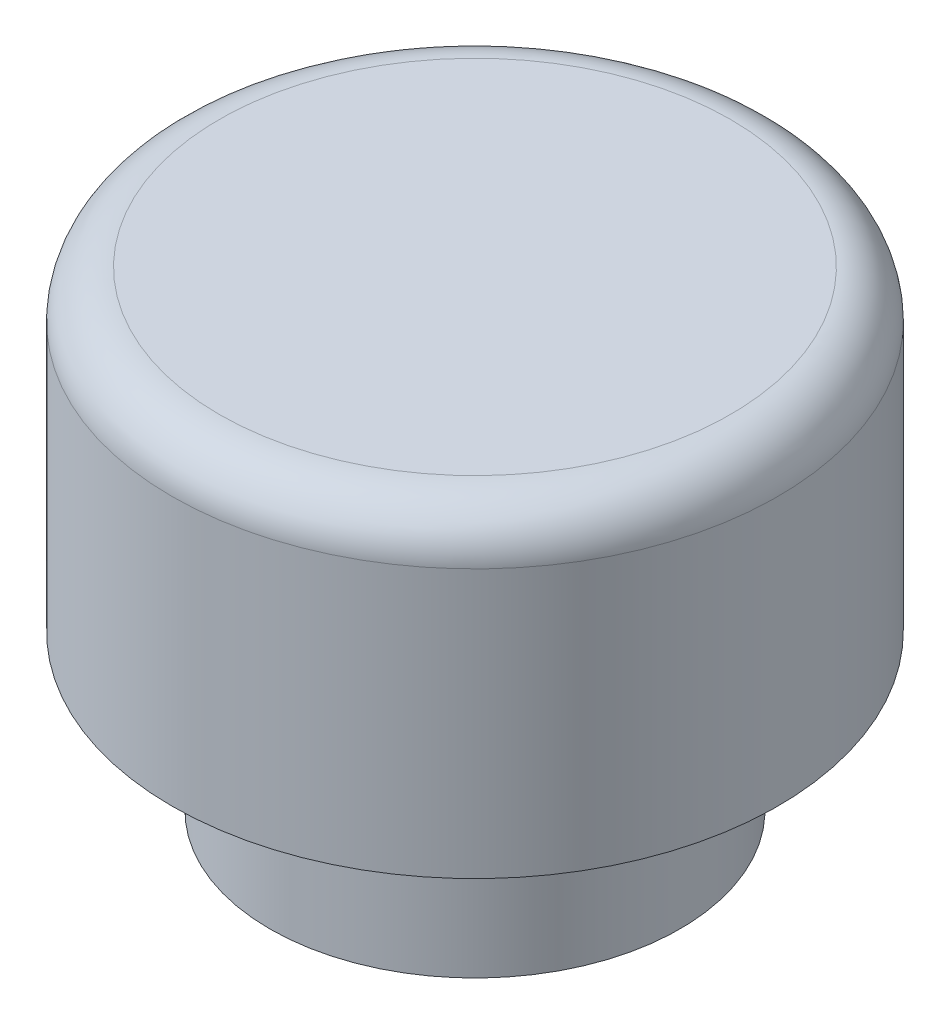
ISO-10303-21;
HEADER;
FILE_DESCRIPTION(('STEP AP214'),'2;1');
FILE_NAME('part.step','',(''),(''),'','','');
FILE_SCHEMA(('AUTOMOTIVE_DESIGN { 1 0 10303 214 1 1 1 1 }'));
ENDSEC;
DATA;
#1=APPLICATION_CONTEXT('core data for automotive mechanical design processes');
#2=APPLICATION_PROTOCOL_DEFINITION('international standard','automotive_design',2000,#1);
#3=PRODUCT_CONTEXT('',#1,'mechanical');
#4=PRODUCT('Part','Part','',(#3));
#5=PRODUCT_RELATED_PRODUCT_CATEGORY('part','',(#4));
#6=PRODUCT_DEFINITION_FORMATION('','',#4);
#7=PRODUCT_DEFINITION_CONTEXT('part definition',#1,'design');
#8=PRODUCT_DEFINITION('design','',#6,#7);
#9=PRODUCT_DEFINITION_SHAPE('','',#8);
#10=(LENGTH_UNIT() NAMED_UNIT(*) SI_UNIT(.MILLI.,.METRE.));
#11=(NAMED_UNIT(*) PLANE_ANGLE_UNIT() SI_UNIT($,.RADIAN.));
#12=(NAMED_UNIT(*) SI_UNIT($,.STERADIAN.) SOLID_ANGLE_UNIT());
#13=UNCERTAINTY_MEASURE_WITH_UNIT(LENGTH_MEASURE(1.E-05),#10,'distance_accuracy_value','');
#14=(GEOMETRIC_REPRESENTATION_CONTEXT(3) GLOBAL_UNCERTAINTY_ASSIGNED_CONTEXT((#13)) GLOBAL_UNIT_ASSIGNED_CONTEXT((#10,
#11,#12)) REPRESENTATION_CONTEXT('',''));
#15=CARTESIAN_POINT('',(0.,0.,0.));
#16=DIRECTION('',(0.,0.,1.));
#17=DIRECTION('',(1.,0.,0.));
#18=AXIS2_PLACEMENT_3D('',#15,#16,#17);
#19=CARTESIAN_POINT('',(0.,2.46,0.));
#20=DIRECTION('',(0.,-1.,0.));
#21=DIRECTION('',(0.,0.,-1.));
#22=AXIS2_PLACEMENT_3D('',#19,#20,#21);
#23=CYLINDRICAL_SURFACE('',#22,3.25);
#24=CARTESIAN_POINT('',(0.,2.46,0.));
#25=DIRECTION('',(0.,1.,0.));
#26=DIRECTION('',(0.,0.,1.));
#27=AXIS2_PLACEMENT_3D('',#24,#25,#26);
#28=CIRCLE('',#27,3.25);
#29=CARTESIAN_POINT('',(0.,2.46,3.25));
#30=VERTEX_POINT('',#29);
#31=EDGE_CURVE('E74',#30,#30,#28,.T.);
#32=ORIENTED_EDGE('',*,*,#31,.F.);
#33=EDGE_LOOP('',(#32));
#34=FACE_BOUND('',#33,.T.);
#35=CARTESIAN_POINT('',(0.,0.,0.));
#36=DIRECTION('',(0.,1.,0.));
#37=DIRECTION('',(0.,0.,1.));
#38=AXIS2_PLACEMENT_3D('',#35,#36,#37);
#39=CIRCLE('',#38,3.25);
#40=CARTESIAN_POINT('',(0.,0.,3.25));
#41=VERTEX_POINT('',#40);
#42=EDGE_CURVE('E79',#41,#41,#39,.T.);
#43=ORIENTED_EDGE('',*,*,#42,.T.);
#44=EDGE_LOOP('',(#43));
#45=FACE_BOUND('',#44,.T.);
#46=ADVANCED_FACE('F61',(#34,#45),#23,.T.);
#47=CARTESIAN_POINT('',(0.,0.,0.));
#48=DIRECTION('',(0.,1.,0.));
#49=DIRECTION('',(0.,0.,1.));
#50=AXIS2_PLACEMENT_3D('',#47,#48,#49);
#51=PLANE('',#50);
#52=CARTESIAN_POINT('',(0.,0.,0.));
#53=DIRECTION('',(0.,-1.,0.));
#54=DIRECTION('',(0.,0.,-1.));
#55=AXIS2_PLACEMENT_3D('',#52,#53,#54);
#56=CIRCLE('',#55,1.75);
#57=CARTESIAN_POINT('',(0.,0.,-1.75));
#58=VERTEX_POINT('',#57);
#59=EDGE_CURVE('E84',#58,#58,#56,.T.);
#60=ORIENTED_EDGE('',*,*,#59,.F.);
#61=EDGE_LOOP('',(#60));
#62=FACE_BOUND('',#61,.T.);
#63=ORIENTED_EDGE('',*,*,#42,.F.);
#64=EDGE_LOOP('',(#63));
#65=FACE_BOUND('',#64,.T.);
#66=ADVANCED_FACE('F113',(#62,#65),#51,.F.);
#67=CARTESIAN_POINT('',(0.,3.35,0.));
#68=DIRECTION('',(0.,-1.,0.));
#69=DIRECTION('',(0.,0.,-1.));
#70=AXIS2_PLACEMENT_3D('',#67,#68,#69);
#71=CYLINDRICAL_SURFACE('',#70,1.75);
#72=CARTESIAN_POINT('',(0.,2.46,0.));
#73=DIRECTION('',(0.,1.,0.));
#74=DIRECTION('',(0.,0.,1.));
#75=AXIS2_PLACEMENT_3D('',#72,#73,#74);
#76=CIRCLE('',#75,1.75);
#77=CARTESIAN_POINT('',(0.,2.46,1.75));
#78=VERTEX_POINT('',#77);
#79=EDGE_CURVE('E86',#78,#78,#76,.T.);
#80=ORIENTED_EDGE('',*,*,#79,.T.);
#81=EDGE_LOOP('',(#80));
#82=FACE_BOUND('',#81,.T.);
#83=ORIENTED_EDGE('',*,*,#59,.T.);
#84=EDGE_LOOP('',(#83));
#85=FACE_BOUND('',#84,.T.);
#86=ADVANCED_FACE('F103',(#82,#85),#71,.F.);
#87=CARTESIAN_POINT('',(0.,2.46,0.));
#88=DIRECTION('',(0.,1.,0.));
#89=DIRECTION('',(0.,0.,1.));
#90=AXIS2_PLACEMENT_3D('',#87,#88,#89);
#91=PLANE('',#90);
#92=ORIENTED_EDGE('',*,*,#31,.T.);
#93=EDGE_LOOP('',(#92));
#94=FACE_BOUND('',#93,.T.);
#95=CARTESIAN_POINT('',(0.,2.46,0.));
#96=DIRECTION('',(0.,1.,0.));
#97=DIRECTION('',(0.,0.,1.));
#98=AXIS2_PLACEMENT_3D('',#95,#96,#97);
#99=CIRCLE('',#98,4.8);
#100=CARTESIAN_POINT('',(0.,2.46,4.8));
#101=VERTEX_POINT('',#100);
#102=EDGE_CURVE('E90',#101,#101,#99,.T.);
#103=ORIENTED_EDGE('',*,*,#102,.F.);
#104=EDGE_LOOP('',(#103));
#105=FACE_BOUND('',#104,.T.);
#106=ADVANCED_FACE('F100',(#94,#105),#91,.F.);
#107=CARTESIAN_POINT('',(0.,7.46,0.));
#108=DIRECTION('',(0.,1.,0.));
#109=DIRECTION('',(0.,0.,1.));
#110=AXIS2_PLACEMENT_3D('',#107,#108,#109);
#111=PLANE('',#110);
#112=CARTESIAN_POINT('',(0.,7.46,0.));
#113=DIRECTION('',(0.,1.,0.));
#114=DIRECTION('',(0.,0.,1.));
#115=AXIS2_PLACEMENT_3D('',#112,#113,#114);
#116=CIRCLE('',#115,4.05);
#117=CARTESIAN_POINT('',(0.,7.46,4.05));
#118=VERTEX_POINT('',#117);
#119=EDGE_CURVE('E69',#118,#118,#116,.T.);
#120=ORIENTED_EDGE('',*,*,#119,.T.);
#121=EDGE_LOOP('',(#120));
#122=FACE_BOUND('',#121,.T.);
#123=ADVANCED_FACE('F102',(#122),#111,.T.);
#124=CARTESIAN_POINT('',(0.,7.46,0.));
#125=DIRECTION('',(0.,-1.,0.));
#126=DIRECTION('',(0.,0.,-1.));
#127=AXIS2_PLACEMENT_3D('',#124,#125,#126);
#128=CYLINDRICAL_SURFACE('',#127,4.8);
#129=CARTESIAN_POINT('',(0.,6.71,0.));
#130=DIRECTION('',(0.,1.,0.));
#131=DIRECTION('',(0.,0.,1.));
#132=AXIS2_PLACEMENT_3D('',#129,#130,#131);
#133=CIRCLE('',#132,4.8);
#134=CARTESIAN_POINT('',(0.,6.71,4.8));
#135=VERTEX_POINT('',#134);
#136=EDGE_CURVE('E11',#135,#135,#133,.F.);
#137=ORIENTED_EDGE('',*,*,#136,.T.);
#138=EDGE_LOOP('',(#137));
#139=FACE_BOUND('',#138,.T.);
#140=ORIENTED_EDGE('',*,*,#102,.T.);
#141=EDGE_LOOP('',(#140));
#142=FACE_BOUND('',#141,.T.);
#143=ADVANCED_FACE('F98',(#139,#142),#128,.T.);
#144=ORIENTED_EDGE('',*,*,#79,.F.);
#145=EDGE_LOOP('',(#144));
#146=FACE_BOUND('',#145,.T.);
#147=ADVANCED_FACE('F106',(#146),#91,.F.);
#148=CARTESIAN_POINT('',(0.,6.71,0.));
#149=DIRECTION('',(0.,1.,0.));
#150=DIRECTION('',(0.,0.,1.));
#151=AXIS2_PLACEMENT_3D('',#148,#149,#150);
#152=TOROIDAL_SURFACE('',#151,4.05,0.75);
#153=ORIENTED_EDGE('',*,*,#136,.F.);
#154=EDGE_LOOP('',(#153));
#155=FACE_BOUND('',#154,.T.);
#156=ORIENTED_EDGE('',*,*,#119,.F.);
#157=EDGE_LOOP('',(#156));
#158=FACE_BOUND('',#157,.T.);
#159=ADVANCED_FACE('F63',(#155,#158),#152,.T.);
#160=CLOSED_SHELL('',(#46,#66,#86,#106,#123,#143,#147,#159));
#161=MANIFOLD_SOLID_BREP('B2',#160);
#162=ADVANCED_BREP_SHAPE_REPRESENTATION('',(#18,#161),#14);
#163=SHAPE_DEFINITION_REPRESENTATION(#9,#162);
ENDSEC;
END-ISO-10303-21;
